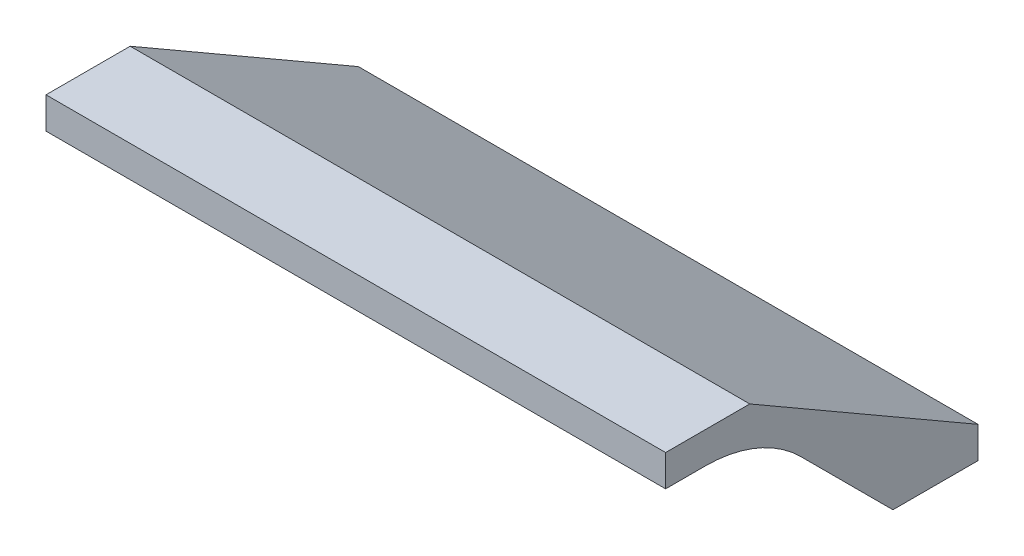
ISO-10303-21;
HEADER;
FILE_DESCRIPTION(('STEP AP214'),'2;1');
FILE_NAME('part.step','',(''),(''),'','','');
FILE_SCHEMA(('AUTOMOTIVE_DESIGN { 1 0 10303 214 1 1 1 1 }'));
ENDSEC;
DATA;
#1=APPLICATION_CONTEXT('core data for automotive mechanical design processes');
#2=APPLICATION_PROTOCOL_DEFINITION('international standard','automotive_design',2000,#1);
#3=PRODUCT_CONTEXT('',#1,'mechanical');
#4=PRODUCT('Part','Part','',(#3));
#5=PRODUCT_RELATED_PRODUCT_CATEGORY('part','',(#4));
#6=PRODUCT_DEFINITION_FORMATION('','',#4);
#7=PRODUCT_DEFINITION_CONTEXT('part definition',#1,'design');
#8=PRODUCT_DEFINITION('design','',#6,#7);
#9=PRODUCT_DEFINITION_SHAPE('','',#8);
#10=(LENGTH_UNIT() NAMED_UNIT(*) SI_UNIT(.MILLI.,.METRE.));
#11=(NAMED_UNIT(*) PLANE_ANGLE_UNIT() SI_UNIT($,.RADIAN.));
#12=(NAMED_UNIT(*) SI_UNIT($,.STERADIAN.) SOLID_ANGLE_UNIT());
#13=UNCERTAINTY_MEASURE_WITH_UNIT(LENGTH_MEASURE(1.E-05),#10,'distance_accuracy_value','');
#14=(GEOMETRIC_REPRESENTATION_CONTEXT(3) GLOBAL_UNCERTAINTY_ASSIGNED_CONTEXT((#13)) GLOBAL_UNIT_ASSIGNED_CONTEXT((#10,
#11,#12)) REPRESENTATION_CONTEXT('',''));
#15=CARTESIAN_POINT('',(0.,0.,0.));
#16=DIRECTION('',(0.,0.,1.));
#17=DIRECTION('',(1.,0.,0.));
#18=AXIS2_PLACEMENT_3D('',#15,#16,#17);
#19=CARTESIAN_POINT('',(-250.,0.,-77.097058469));
#20=DIRECTION('',(0.,1.,0.));
#21=DIRECTION('',(0.,0.,1.));
#22=AXIS2_PLACEMENT_3D('',#19,#20,#21);
#23=PLANE('',#22);
#24=DIRECTION('',(0.,0.,1.));
#25=VECTOR('',#24,1.);
#26=CARTESIAN_POINT('',(-250.,0.,-77.097058469));
#27=LINE('',#26,#25);
#28=CARTESIAN_POINT('',(-250.,0.,-31.8106775344438));
#29=VERTEX_POINT('',#28);
#30=CARTESIAN_POINT('',(-250.,0.,0.));
#31=VERTEX_POINT('',#30);
#32=EDGE_CURVE('E324',#29,#31,#27,.T.);
#33=ORIENTED_EDGE('',*,*,#32,.F.);
#34=DIRECTION('',(1.,0.,0.));
#35=VECTOR('',#34,1.);
#36=CARTESIAN_POINT('',(250.,0.,-31.8106775344438));
#37=LINE('',#36,#35);
#38=CARTESIAN_POINT('',(-139.7,0.,-31.810677540606));
#39=VERTEX_POINT('',#38);
#40=EDGE_CURVE('E293',#29,#39,#37,.T.);
#41=ORIENTED_EDGE('',*,*,#40,.T.);
#42=DIRECTION('',(0.,0.,-1.));
#43=VECTOR('',#42,1.);
#44=CARTESIAN_POINT('',(-139.7,0.,-31.810677540606));
#45=LINE('',#44,#43);
#46=CARTESIAN_POINT('',(-139.7,0.,-6.41067752457025));
#47=VERTEX_POINT('',#46);
#48=EDGE_CURVE('E310',#47,#39,#45,.T.);
#49=ORIENTED_EDGE('',*,*,#48,.F.);
#50=DIRECTION('',(-1.,0.,0.));
#51=VECTOR('',#50,1.);
#52=CARTESIAN_POINT('',(-139.7,0.,-6.41067752457025));
#53=LINE('',#52,#51);
#54=CARTESIAN_POINT('',(-50.8,0.,-6.41067752457025));
#55=VERTEX_POINT('',#54);
#56=EDGE_CURVE('E227',#55,#47,#53,.T.);
#57=ORIENTED_EDGE('',*,*,#56,.F.);
#58=DIRECTION('',(0.,0.,1.));
#59=VECTOR('',#58,1.);
#60=CARTESIAN_POINT('',(-50.8,0.,-6.41067752457025));
#61=LINE('',#60,#59);
#62=CARTESIAN_POINT('',(-50.8,0.,-31.810677540606));
#63=VERTEX_POINT('',#62);
#64=EDGE_CURVE('E222',#63,#55,#61,.T.);
#65=ORIENTED_EDGE('',*,*,#64,.F.);
#66=DIRECTION('',(1.,0.,0.));
#67=VECTOR('',#66,1.);
#68=CARTESIAN_POINT('',(250.,0.,-31.8106775344438));
#69=LINE('',#68,#67);
#70=CARTESIAN_POINT('',(50.8,0.,-31.810677540606));
#71=VERTEX_POINT('',#70);
#72=EDGE_CURVE('E285',#63,#71,#69,.T.);
#73=ORIENTED_EDGE('',*,*,#72,.T.);
#74=DIRECTION('',(0.,0.,-1.));
#75=VECTOR('',#74,1.);
#76=CARTESIAN_POINT('',(50.8,0.,-31.810677540606));
#77=LINE('',#76,#75);
#78=CARTESIAN_POINT('',(50.8,0.,-6.41067753108884));
#79=VERTEX_POINT('',#78);
#80=EDGE_CURVE('E215',#79,#71,#77,.T.);
#81=ORIENTED_EDGE('',*,*,#80,.F.);
#82=DIRECTION('',(-1.,0.,0.));
#83=VECTOR('',#82,1.);
#84=CARTESIAN_POINT('',(50.8,0.,-6.41067753108884));
#85=LINE('',#84,#83);
#86=CARTESIAN_POINT('',(139.7,0.,-6.41067753108884));
#87=VERTEX_POINT('',#86);
#88=EDGE_CURVE('E270',#87,#79,#85,.T.);
#89=ORIENTED_EDGE('',*,*,#88,.F.);
#90=DIRECTION('',(0.,0.,1.));
#91=VECTOR('',#90,1.);
#92=CARTESIAN_POINT('',(139.7,0.,-6.41067753108884));
#93=LINE('',#92,#91);
#94=CARTESIAN_POINT('',(139.7,0.,-31.810677540606));
#95=VERTEX_POINT('',#94);
#96=EDGE_CURVE('E267',#95,#87,#93,.T.);
#97=ORIENTED_EDGE('',*,*,#96,.F.);
#98=DIRECTION('',(1.,0.,0.));
#99=VECTOR('',#98,1.);
#100=CARTESIAN_POINT('',(250.,0.,-31.8106775344438));
#101=LINE('',#100,#99);
#102=CARTESIAN_POINT('',(250.,0.,-31.8106775344438));
#103=VERTEX_POINT('',#102);
#104=EDGE_CURVE('E280',#95,#103,#101,.T.);
#105=ORIENTED_EDGE('',*,*,#104,.T.);
#106=DIRECTION('',(0.,0.,1.));
#107=VECTOR('',#106,1.);
#108=CARTESIAN_POINT('',(250.,0.,-77.097058469));
#109=LINE('',#108,#107);
#110=CARTESIAN_POINT('',(250.,0.,0.));
#111=VERTEX_POINT('',#110);
#112=EDGE_CURVE('E336',#103,#111,#109,.T.);
#113=ORIENTED_EDGE('',*,*,#112,.T.);
#114=DIRECTION('',(1.,0.,0.));
#115=VECTOR('',#114,1.);
#116=CARTESIAN_POINT('',(-250.,0.,0.));
#117=LINE('',#116,#115);
#118=EDGE_CURVE('E403',#31,#111,#117,.T.);
#119=ORIENTED_EDGE('',*,*,#118,.F.);
#120=EDGE_LOOP('',(#33,#41,#49,#57,#65,#73,#81,#89,#97,#105,#113,#119));
#121=FACE_BOUND('',#120,.T.);
#122=ADVANCED_FACE('F45',(#121),#23,.F.);
#123=CARTESIAN_POINT('',(250.,-80.9302510564665,-252.081136019574));
#124=DIRECTION('',(0.,0.,-1.));
#125=DIRECTION('',(-1.,0.,0.));
#126=AXIS2_PLACEMENT_3D('',#123,#124,#125);
#127=PLANE('',#126);
#128=DIRECTION('',(0.,-1.,0.));
#129=VECTOR('',#128,1.);
#130=CARTESIAN_POINT('',(-250.,-80.9302510564665,-252.081136019574));
#131=LINE('',#130,#129);
#132=CARTESIAN_POINT('',(-250.,-80.9302510564665,-252.081136019574));
#133=VERTEX_POINT('',#132);
#134=CARTESIAN_POINT('',(-250.,-106.330251064987,-252.081136019574));
#135=VERTEX_POINT('',#134);
#136=EDGE_CURVE('E399',#133,#135,#131,.T.);
#137=ORIENTED_EDGE('',*,*,#136,.F.);
#138=DIRECTION('',(-1.,0.,0.));
#139=VECTOR('',#138,1.);
#140=CARTESIAN_POINT('',(250.,-80.9302510564665,-252.081136019574));
#141=LINE('',#140,#139);
#142=CARTESIAN_POINT('',(250.,-80.9302510564665,-252.081136019574));
#143=VERTEX_POINT('',#142);
#144=EDGE_CURVE('E286',#143,#133,#141,.T.);
#145=ORIENTED_EDGE('',*,*,#144,.F.);
#146=DIRECTION('',(0.,-1.,0.));
#147=VECTOR('',#146,1.);
#148=CARTESIAN_POINT('',(250.,-80.9302510564665,-252.081136019574));
#149=LINE('',#148,#147);
#150=CARTESIAN_POINT('',(250.,-106.330251064987,-252.081136019574));
#151=VERTEX_POINT('',#150);
#152=EDGE_CURVE('E408',#143,#151,#149,.T.);
#153=ORIENTED_EDGE('',*,*,#152,.T.);
#154=DIRECTION('',(-1.,0.,0.));
#155=VECTOR('',#154,1.);
#156=CARTESIAN_POINT('',(250.,-106.330251064987,-252.081136019574));
#157=LINE('',#156,#155);
#158=EDGE_CURVE('E287',#151,#135,#157,.T.);
#159=ORIENTED_EDGE('',*,*,#158,.T.);
#160=EDGE_LOOP('',(#137,#145,#153,#159));
#161=FACE_BOUND('',#160,.T.);
#162=ADVANCED_FACE('F504',(#161),#127,.T.);
#163=CARTESIAN_POINT('',(250.,25.401284991,-67.9095131385199));
#164=DIRECTION('',(0.,0.866025403784439,-0.5));
#165=DIRECTION('',(0.,0.5,0.866025403784439));
#166=AXIS2_PLACEMENT_3D('',#163,#164,#165);
#167=PLANE('',#166);
#168=DIRECTION('',(0.,-0.5,-0.866025403784439));
#169=VECTOR('',#168,1.);
#170=CARTESIAN_POINT('',(-250.,25.401284991,-67.9095131385199));
#171=LINE('',#170,#169);
#172=CARTESIAN_POINT('',(-250.,25.401284991,-67.9095131385199));
#173=VERTEX_POINT('',#172);
#174=EDGE_CURVE('E405',#173,#133,#171,.T.);
#175=ORIENTED_EDGE('',*,*,#174,.F.);
#176=DIRECTION('',(-1.,0.,0.));
#177=VECTOR('',#176,1.);
#178=CARTESIAN_POINT('',(250.,25.401284991,-67.9095131385199));
#179=LINE('',#178,#177);
#180=CARTESIAN_POINT('',(250.,25.401284991,-67.9095131385199));
#181=VERTEX_POINT('',#180);
#182=EDGE_CURVE('E485',#181,#173,#179,.T.);
#183=ORIENTED_EDGE('',*,*,#182,.F.);
#184=DIRECTION('',(0.,-0.5,-0.866025403784439));
#185=VECTOR('',#184,1.);
#186=CARTESIAN_POINT('',(250.,25.401284991,-67.9095131385199));
#187=LINE('',#186,#185);
#188=EDGE_CURVE('E453',#181,#143,#187,.T.);
#189=ORIENTED_EDGE('',*,*,#188,.T.);
#190=ORIENTED_EDGE('',*,*,#144,.T.);
#191=EDGE_LOOP('',(#175,#183,#189,#190));
#192=FACE_BOUND('',#191,.T.);
#193=ADVANCED_FACE('F500',(#192),#167,.T.);
#194=CARTESIAN_POINT('',(250.,25.401284991,0.));
#195=DIRECTION('',(0.,1.,0.));
#196=DIRECTION('',(0.,0.,1.));
#197=AXIS2_PLACEMENT_3D('',#194,#195,#196);
#198=PLANE('',#197);
#199=DIRECTION('',(0.,0.,-1.));
#200=VECTOR('',#199,1.);
#201=CARTESIAN_POINT('',(-250.,25.401284991,0.));
#202=LINE('',#201,#200);
#203=CARTESIAN_POINT('',(-250.,25.401284991,0.));
#204=VERTEX_POINT('',#203);
#205=EDGE_CURVE('E409',#204,#173,#202,.T.);
#206=ORIENTED_EDGE('',*,*,#205,.F.);
#207=DIRECTION('',(-1.,0.,0.));
#208=VECTOR('',#207,1.);
#209=CARTESIAN_POINT('',(250.,25.401284991,0.));
#210=LINE('',#209,#208);
#211=CARTESIAN_POINT('',(250.,25.401284991,0.));
#212=VERTEX_POINT('',#211);
#213=EDGE_CURVE('E481',#212,#204,#210,.T.);
#214=ORIENTED_EDGE('',*,*,#213,.F.);
#215=DIRECTION('',(0.,0.,-1.));
#216=VECTOR('',#215,1.);
#217=CARTESIAN_POINT('',(250.,25.401284991,0.));
#218=LINE('',#217,#216);
#219=EDGE_CURVE('E446',#212,#181,#218,.T.);
#220=ORIENTED_EDGE('',*,*,#219,.T.);
#221=ORIENTED_EDGE('',*,*,#182,.T.);
#222=EDGE_LOOP('',(#206,#214,#220,#221));
#223=FACE_BOUND('',#222,.T.);
#224=ADVANCED_FACE('F511',(#223),#198,.T.);
#225=CARTESIAN_POINT('',(250.,-106.330251064987,0.));
#226=DIRECTION('',(0.,0.,1.));
#227=DIRECTION('',(0.,-1.,0.));
#228=AXIS2_PLACEMENT_3D('',#225,#226,#227);
#229=PLANE('',#228);
#230=ORIENTED_EDGE('',*,*,#118,.T.);
#231=DIRECTION('',(0.,1.,0.));
#232=VECTOR('',#231,1.);
#233=CARTESIAN_POINT('',(250.,-106.330251064987,0.));
#234=LINE('',#233,#232);
#235=EDGE_CURVE('E443',#111,#212,#234,.T.);
#236=ORIENTED_EDGE('',*,*,#235,.T.);
#237=ORIENTED_EDGE('',*,*,#213,.T.);
#238=DIRECTION('',(0.,1.,0.));
#239=VECTOR('',#238,1.);
#240=CARTESIAN_POINT('',(-250.,-106.330251064987,0.));
#241=LINE('',#240,#239);
#242=EDGE_CURVE('E398',#31,#204,#241,.T.);
#243=ORIENTED_EDGE('',*,*,#242,.F.);
#244=EDGE_LOOP('',(#230,#236,#237,#243));
#245=FACE_BOUND('',#244,.T.);
#246=ADVANCED_FACE('F643',(#245),#229,.T.);
#247=CARTESIAN_POINT('',(250.,-106.330251064987,-252.081136019574));
#248=DIRECTION('',(0.,-1.,0.));
#249=DIRECTION('',(0.,0.,-1.));
#250=AXIS2_PLACEMENT_3D('',#247,#248,#249);
#251=PLANE('',#250);
#252=DIRECTION('',(1.,0.,0.));
#253=VECTOR('',#252,1.);
#254=CARTESIAN_POINT('',(-250.,-106.33025104,-183.427309509));
#255=LINE('',#254,#253);
#256=CARTESIAN_POINT('',(-250.,-106.33025104,-183.427309509));
#257=VERTEX_POINT('',#256);
#258=CARTESIAN_POINT('',(250.,-106.33025104,-183.427309509));
#259=VERTEX_POINT('',#258);
#260=EDGE_CURVE('E329',#257,#259,#255,.T.);
#261=ORIENTED_EDGE('',*,*,#260,.F.);
#262=DIRECTION('',(0.,0.,1.));
#263=VECTOR('',#262,1.);
#264=CARTESIAN_POINT('',(-250.,-106.330251064987,-252.081136019574));
#265=LINE('',#264,#263);
#266=EDGE_CURVE('E395',#135,#257,#265,.T.);
#267=ORIENTED_EDGE('',*,*,#266,.F.);
#268=ORIENTED_EDGE('',*,*,#158,.F.);
#269=DIRECTION('',(0.,0.,1.));
#270=VECTOR('',#269,1.);
#271=CARTESIAN_POINT('',(250.,-106.330251064987,-252.081136019574));
#272=LINE('',#271,#270);
#273=EDGE_CURVE('E450',#151,#259,#272,.T.);
#274=ORIENTED_EDGE('',*,*,#273,.T.);
#275=EDGE_LOOP('',(#261,#267,#268,#274));
#276=FACE_BOUND('',#275,.T.);
#277=ADVANCED_FACE('F518',(#276),#251,.T.);
#278=CARTESIAN_POINT('',(250.,0.,0.));
#279=DIRECTION('',(-1.,0.,0.));
#280=DIRECTION('',(0.,0.,1.));
#281=AXIS2_PLACEMENT_3D('',#278,#279,#280);
#282=PLANE('',#281);
#283=ORIENTED_EDGE('',*,*,#235,.F.);
#284=ORIENTED_EDGE('',*,*,#112,.F.);
#285=CARTESIAN_POINT('',(250.,-109.330995043,-31.8106775344438));
#286=DIRECTION('',(-1.,0.,0.));
#287=DIRECTION('',(0.,0.,1.));
#288=AXIS2_PLACEMENT_3D('',#285,#286,#287);
#289=CIRCLE('',#288,109.330995043);
#290=CARTESIAN_POINT('',(250.,-32.0223070542218,-109.119365523222));
#291=VERTEX_POINT('',#290);
#292=EDGE_CURVE('E55',#103,#291,#289,.T.);
#293=ORIENTED_EDGE('',*,*,#292,.T.);
#294=DIRECTION('',(0.,0.707106781186547,0.707106781186548));
#295=VECTOR('',#294,1.);
#296=CARTESIAN_POINT('',(250.,-106.33025104,-183.427309509));
#297=LINE('',#296,#295);
#298=EDGE_CURVE('E333',#259,#291,#297,.T.);
#299=ORIENTED_EDGE('',*,*,#298,.F.);
#300=ORIENTED_EDGE('',*,*,#273,.F.);
#301=ORIENTED_EDGE('',*,*,#152,.F.);
#302=ORIENTED_EDGE('',*,*,#188,.F.);
#303=ORIENTED_EDGE('',*,*,#219,.F.);
#304=EDGE_LOOP('',(#283,#284,#293,#299,#300,#301,#302,#303));
#305=FACE_BOUND('',#304,.T.);
#306=ADVANCED_FACE('F441',(#305),#282,.F.);
#307=CARTESIAN_POINT('',(-250.,0.,0.));
#308=DIRECTION('',(-1.,0.,0.));
#309=DIRECTION('',(0.,0.,1.));
#310=AXIS2_PLACEMENT_3D('',#307,#308,#309);
#311=PLANE('',#310);
#312=DIRECTION('',(0.,0.707106781186547,0.707106781186548));
#313=VECTOR('',#312,1.);
#314=CARTESIAN_POINT('',(-250.,-106.33025104,-183.427309509));
#315=LINE('',#314,#313);
#316=CARTESIAN_POINT('',(-250.,-32.0223070542218,-109.119365523222));
#317=VERTEX_POINT('',#316);
#318=EDGE_CURVE('E330',#257,#317,#315,.T.);
#319=ORIENTED_EDGE('',*,*,#318,.T.);
#320=CARTESIAN_POINT('',(-250.,-109.330995043,-31.8106775344438));
#321=DIRECTION('',(-1.,0.,0.));
#322=DIRECTION('',(0.,0.,1.));
#323=AXIS2_PLACEMENT_3D('',#320,#321,#322);
#324=CIRCLE('',#323,109.330995043);
#325=EDGE_CURVE('E12',#317,#29,#324,.F.);
#326=ORIENTED_EDGE('',*,*,#325,.T.);
#327=ORIENTED_EDGE('',*,*,#32,.T.);
#328=ORIENTED_EDGE('',*,*,#242,.T.);
#329=ORIENTED_EDGE('',*,*,#205,.T.);
#330=ORIENTED_EDGE('',*,*,#174,.T.);
#331=ORIENTED_EDGE('',*,*,#136,.T.);
#332=ORIENTED_EDGE('',*,*,#266,.T.);
#333=EDGE_LOOP('',(#319,#326,#327,#328,#329,#330,#331,#332));
#334=FACE_BOUND('',#333,.T.);
#335=ADVANCED_FACE('F507',(#334),#311,.T.);
#336=CARTESIAN_POINT('',(-250.,-106.33025104,-183.427309509));
#337=DIRECTION('',(0.,0.707106781186548,-0.707106781186547));
#338=DIRECTION('',(0.,0.707106781186547,0.707106781186548));
#339=AXIS2_PLACEMENT_3D('',#336,#337,#338);
#340=PLANE('',#339);
#341=ORIENTED_EDGE('',*,*,#298,.T.);
#342=DIRECTION('',(1.,0.,0.));
#343=VECTOR('',#342,1.);
#344=CARTESIAN_POINT('',(-250.,-32.0223070542218,-109.119365523222));
#345=LINE('',#344,#343);
#346=EDGE_CURVE('E65',#291,#317,#345,.F.);
#347=ORIENTED_EDGE('',*,*,#346,.T.);
#348=ORIENTED_EDGE('',*,*,#318,.F.);
#349=ORIENTED_EDGE('',*,*,#260,.T.);
#350=EDGE_LOOP('',(#341,#347,#348,#349));
#351=FACE_BOUND('',#350,.T.);
#352=ADVANCED_FACE('F519',(#351),#340,.F.);
#353=CARTESIAN_POINT('',(-50.8,-1.,-6.41067752457025));
#354=DIRECTION('',(-1.,0.,0.));
#355=DIRECTION('',(0.,0.,1.));
#356=AXIS2_PLACEMENT_3D('',#353,#354,#355);
#357=PLANE('',#356);
#358=ORIENTED_EDGE('',*,*,#64,.T.);
#359=DIRECTION('',(0.,1.,0.));
#360=VECTOR('',#359,1.);
#361=CARTESIAN_POINT('',(-50.8,-1.,-6.41067752457025));
#362=LINE('',#361,#360);
#363=CARTESIAN_POINT('',(-50.8,-1.,-6.41067752457025));
#364=VERTEX_POINT('',#363);
#365=EDGE_CURVE('E337',#364,#55,#362,.T.);
#366=ORIENTED_EDGE('',*,*,#365,.F.);
#367=DIRECTION('',(0.,0.,1.));
#368=VECTOR('',#367,1.);
#369=CARTESIAN_POINT('',(-50.8,-1.,-6.41067752457025));
#370=LINE('',#369,#368);
#371=CARTESIAN_POINT('',(-50.8,-1.,-31.810677540606));
#372=VERTEX_POINT('',#371);
#373=EDGE_CURVE('E236',#372,#364,#370,.T.);
#374=ORIENTED_EDGE('',*,*,#373,.F.);
#375=DIRECTION('',(0.,1.,0.));
#376=VECTOR('',#375,1.);
#377=CARTESIAN_POINT('',(-50.8,-1.,-31.810677540606));
#378=LINE('',#377,#376);
#379=EDGE_CURVE('E348',#372,#63,#378,.T.);
#380=ORIENTED_EDGE('',*,*,#379,.T.);
#381=EDGE_LOOP('',(#358,#366,#374,#380));
#382=FACE_BOUND('',#381,.T.);
#383=ADVANCED_FACE('F387',(#382),#357,.F.);
#384=CARTESIAN_POINT('',(-139.7,-1.,-6.41067752457025));
#385=DIRECTION('',(0.,0.,-1.));
#386=DIRECTION('',(-1.,0.,0.));
#387=AXIS2_PLACEMENT_3D('',#384,#385,#386);
#388=PLANE('',#387);
#389=ORIENTED_EDGE('',*,*,#56,.T.);
#390=DIRECTION('',(0.,1.,0.));
#391=VECTOR('',#390,1.);
#392=CARTESIAN_POINT('',(-139.7,-1.,-6.41067752457025));
#393=LINE('',#392,#391);
#394=CARTESIAN_POINT('',(-139.7,-1.,-6.41067752457025));
#395=VERTEX_POINT('',#394);
#396=EDGE_CURVE('E358',#395,#47,#393,.T.);
#397=ORIENTED_EDGE('',*,*,#396,.F.);
#398=DIRECTION('',(-1.,0.,0.));
#399=VECTOR('',#398,1.);
#400=CARTESIAN_POINT('',(-139.7,-1.,-6.41067752457025));
#401=LINE('',#400,#399);
#402=EDGE_CURVE('E364',#364,#395,#401,.T.);
#403=ORIENTED_EDGE('',*,*,#402,.F.);
#404=ORIENTED_EDGE('',*,*,#365,.T.);
#405=EDGE_LOOP('',(#389,#397,#403,#404));
#406=FACE_BOUND('',#405,.T.);
#407=ADVANCED_FACE('F436',(#406),#388,.F.);
#408=CARTESIAN_POINT('',(-139.7,-1.,-31.810677540606));
#409=DIRECTION('',(1.,0.,0.));
#410=DIRECTION('',(0.,0.,-1.));
#411=AXIS2_PLACEMENT_3D('',#408,#409,#410);
#412=PLANE('',#411);
#413=ORIENTED_EDGE('',*,*,#48,.T.);
#414=DIRECTION('',(0.,1.,0.));
#415=VECTOR('',#414,1.);
#416=CARTESIAN_POINT('',(-139.7,-1.,-31.810677540606));
#417=LINE('',#416,#415);
#418=CARTESIAN_POINT('',(-139.7,-1.,-31.810677540606));
#419=VERTEX_POINT('',#418);
#420=EDGE_CURVE('E353',#419,#39,#417,.T.);
#421=ORIENTED_EDGE('',*,*,#420,.F.);
#422=DIRECTION('',(0.,0.,-1.));
#423=VECTOR('',#422,1.);
#424=CARTESIAN_POINT('',(-139.7,-1.,-31.810677540606));
#425=LINE('',#424,#423);
#426=EDGE_CURVE('E367',#395,#419,#425,.T.);
#427=ORIENTED_EDGE('',*,*,#426,.F.);
#428=ORIENTED_EDGE('',*,*,#396,.T.);
#429=EDGE_LOOP('',(#413,#421,#427,#428));
#430=FACE_BOUND('',#429,.T.);
#431=ADVANCED_FACE('F432',(#430),#412,.F.);
#432=CARTESIAN_POINT('',(-50.8,-1.,-31.810677540606));
#433=DIRECTION('',(0.,0.,1.));
#434=DIRECTION('',(1.,0.,0.));
#435=AXIS2_PLACEMENT_3D('',#432,#433,#434);
#436=PLANE('',#435);
#437=DIRECTION('',(1.,0.,0.));
#438=VECTOR('',#437,1.);
#439=CARTESIAN_POINT('',(-50.8,0.,-31.810677540606));
#440=LINE('',#439,#438);
#441=EDGE_CURVE('E315',#39,#63,#440,.T.);
#442=ORIENTED_EDGE('',*,*,#441,.T.);
#443=ORIENTED_EDGE('',*,*,#379,.F.);
#444=DIRECTION('',(1.,0.,0.));
#445=VECTOR('',#444,1.);
#446=CARTESIAN_POINT('',(-50.8,-1.,-31.810677540606));
#447=LINE('',#446,#445);
#448=EDGE_CURVE('E303',#419,#372,#447,.T.);
#449=ORIENTED_EDGE('',*,*,#448,.F.);
#450=ORIENTED_EDGE('',*,*,#420,.T.);
#451=EDGE_LOOP('',(#442,#443,#449,#450));
#452=FACE_BOUND('',#451,.T.);
#453=ADVANCED_FACE('F384',(#452),#436,.F.);
#454=CARTESIAN_POINT('',(0.,-1.,0.));
#455=DIRECTION('',(0.,1.,0.));
#456=DIRECTION('',(0.,0.,1.));
#457=AXIS2_PLACEMENT_3D('',#454,#455,#456);
#458=PLANE('',#457);
#459=ORIENTED_EDGE('',*,*,#373,.T.);
#460=ORIENTED_EDGE('',*,*,#402,.T.);
#461=ORIENTED_EDGE('',*,*,#426,.T.);
#462=ORIENTED_EDGE('',*,*,#448,.T.);
#463=EDGE_LOOP('',(#459,#460,#461,#462));
#464=FACE_BOUND('',#463,.T.);
#465=ADVANCED_FACE('F379',(#464),#458,.F.);
#466=CARTESIAN_POINT('',(139.7,-1.,-31.810677540606));
#467=DIRECTION('',(0.,0.,1.));
#468=DIRECTION('',(1.,0.,0.));
#469=AXIS2_PLACEMENT_3D('',#466,#467,#468);
#470=PLANE('',#469);
#471=DIRECTION('',(1.,0.,0.));
#472=VECTOR('',#471,1.);
#473=CARTESIAN_POINT('',(139.7,0.,-31.810677540606));
#474=LINE('',#473,#472);
#475=EDGE_CURVE('E219',#71,#95,#474,.T.);
#476=ORIENTED_EDGE('',*,*,#475,.T.);
#477=DIRECTION('',(0.,1.,0.));
#478=VECTOR('',#477,1.);
#479=CARTESIAN_POINT('',(139.7,-1.,-31.810677540606));
#480=LINE('',#479,#478);
#481=CARTESIAN_POINT('',(139.7,-1.,-31.810677540606));
#482=VERTEX_POINT('',#481);
#483=EDGE_CURVE('E197',#482,#95,#480,.T.);
#484=ORIENTED_EDGE('',*,*,#483,.F.);
#485=DIRECTION('',(1.,0.,0.));
#486=VECTOR('',#485,1.);
#487=CARTESIAN_POINT('',(139.7,-1.,-31.810677540606));
#488=LINE('',#487,#486);
#489=CARTESIAN_POINT('',(50.8,-1.,-31.810677540606));
#490=VERTEX_POINT('',#489);
#491=EDGE_CURVE('E205',#490,#482,#488,.T.);
#492=ORIENTED_EDGE('',*,*,#491,.F.);
#493=DIRECTION('',(0.,1.,0.));
#494=VECTOR('',#493,1.);
#495=CARTESIAN_POINT('',(50.8,-1.,-31.810677540606));
#496=LINE('',#495,#494);
#497=EDGE_CURVE('E250',#490,#71,#496,.T.);
#498=ORIENTED_EDGE('',*,*,#497,.T.);
#499=EDGE_LOOP('',(#476,#484,#492,#498));
#500=FACE_BOUND('',#499,.T.);
#501=ADVANCED_FACE('F217',(#500),#470,.F.);
#502=CARTESIAN_POINT('',(139.7,-1.,-6.41067753108884));
#503=DIRECTION('',(-1.,0.,0.));
#504=DIRECTION('',(0.,0.,1.));
#505=AXIS2_PLACEMENT_3D('',#502,#503,#504);
#506=PLANE('',#505);
#507=ORIENTED_EDGE('',*,*,#96,.T.);
#508=DIRECTION('',(0.,1.,0.));
#509=VECTOR('',#508,1.);
#510=CARTESIAN_POINT('',(139.7,-1.,-6.41067753108884));
#511=LINE('',#510,#509);
#512=CARTESIAN_POINT('',(139.7,-1.,-6.41067753108884));
#513=VERTEX_POINT('',#512);
#514=EDGE_CURVE('E200',#513,#87,#511,.T.);
#515=ORIENTED_EDGE('',*,*,#514,.F.);
#516=DIRECTION('',(0.,0.,1.));
#517=VECTOR('',#516,1.);
#518=CARTESIAN_POINT('',(139.7,-1.,-6.41067753108884));
#519=LINE('',#518,#517);
#520=EDGE_CURVE('E192',#482,#513,#519,.T.);
#521=ORIENTED_EDGE('',*,*,#520,.F.);
#522=ORIENTED_EDGE('',*,*,#483,.T.);
#523=EDGE_LOOP('',(#507,#515,#521,#522));
#524=FACE_BOUND('',#523,.T.);
#525=ADVANCED_FACE('F195',(#524),#506,.F.);
#526=CARTESIAN_POINT('',(50.8,-1.,-6.41067753108884));
#527=DIRECTION('',(0.,0.,-1.));
#528=DIRECTION('',(-1.,0.,0.));
#529=AXIS2_PLACEMENT_3D('',#526,#527,#528);
#530=PLANE('',#529);
#531=ORIENTED_EDGE('',*,*,#88,.T.);
#532=DIRECTION('',(0.,1.,0.));
#533=VECTOR('',#532,1.);
#534=CARTESIAN_POINT('',(50.8,-1.,-6.41067753108884));
#535=LINE('',#534,#533);
#536=CARTESIAN_POINT('',(50.8,-1.,-6.41067753108884));
#537=VERTEX_POINT('',#536);
#538=EDGE_CURVE('E230',#537,#79,#535,.T.);
#539=ORIENTED_EDGE('',*,*,#538,.F.);
#540=DIRECTION('',(-1.,0.,0.));
#541=VECTOR('',#540,1.);
#542=CARTESIAN_POINT('',(50.8,-1.,-6.41067753108884));
#543=LINE('',#542,#541);
#544=EDGE_CURVE('E204',#513,#537,#543,.T.);
#545=ORIENTED_EDGE('',*,*,#544,.F.);
#546=ORIENTED_EDGE('',*,*,#514,.T.);
#547=EDGE_LOOP('',(#531,#539,#545,#546));
#548=FACE_BOUND('',#547,.T.);
#549=ADVANCED_FACE('F560',(#548),#530,.F.);
#550=CARTESIAN_POINT('',(50.8,-1.,-31.810677540606));
#551=DIRECTION('',(1.,0.,0.));
#552=DIRECTION('',(0.,0.,-1.));
#553=AXIS2_PLACEMENT_3D('',#550,#551,#552);
#554=PLANE('',#553);
#555=ORIENTED_EDGE('',*,*,#80,.T.);
#556=ORIENTED_EDGE('',*,*,#497,.F.);
#557=DIRECTION('',(0.,0.,-1.));
#558=VECTOR('',#557,1.);
#559=CARTESIAN_POINT('',(50.8,-1.,-31.810677540606));
#560=LINE('',#559,#558);
#561=EDGE_CURVE('E210',#537,#490,#560,.T.);
#562=ORIENTED_EDGE('',*,*,#561,.F.);
#563=ORIENTED_EDGE('',*,*,#538,.T.);
#564=EDGE_LOOP('',(#555,#556,#562,#563));
#565=FACE_BOUND('',#564,.T.);
#566=ADVANCED_FACE('F438',(#565),#554,.F.);
#567=CARTESIAN_POINT('',(0.,-1.,0.));
#568=DIRECTION('',(0.,1.,0.));
#569=DIRECTION('',(0.,0.,1.));
#570=AXIS2_PLACEMENT_3D('',#567,#568,#569);
#571=PLANE('',#570);
#572=ORIENTED_EDGE('',*,*,#491,.T.);
#573=ORIENTED_EDGE('',*,*,#520,.T.);
#574=ORIENTED_EDGE('',*,*,#544,.T.);
#575=ORIENTED_EDGE('',*,*,#561,.T.);
#576=EDGE_LOOP('',(#572,#573,#574,#575));
#577=FACE_BOUND('',#576,.T.);
#578=ADVANCED_FACE('F208',(#577),#571,.F.);
#579=CARTESIAN_POINT('',(-250.,-109.330995043,-31.8106775344438));
#580=DIRECTION('',(-1.,0.,0.));
#581=DIRECTION('',(0.,0.,1.));
#582=AXIS2_PLACEMENT_3D('',#579,#580,#581);
#583=CYLINDRICAL_SURFACE('',#582,109.330995043);
#584=ORIENTED_EDGE('',*,*,#325,.F.);
#585=ORIENTED_EDGE('',*,*,#346,.F.);
#586=ORIENTED_EDGE('',*,*,#292,.F.);
#587=ORIENTED_EDGE('',*,*,#104,.F.);
#588=ORIENTED_EDGE('',*,*,#475,.F.);
#589=ORIENTED_EDGE('',*,*,#72,.F.);
#590=ORIENTED_EDGE('',*,*,#441,.F.);
#591=ORIENTED_EDGE('',*,*,#40,.F.);
#592=EDGE_LOOP('',(#584,#585,#586,#587,#588,#589,#590,#591));
#593=FACE_BOUND('',#592,.T.);
#594=ADVANCED_FACE('F48',(#593),#583,.F.);
#595=CLOSED_SHELL('',(#122,#162,#193,#224,#246,#277,#306,#335,#352,#383,#407,#431,#453,#465,
#501,#525,#549,#566,#578,#594));
#596=MANIFOLD_SOLID_BREP('B2',#595);
#597=ADVANCED_BREP_SHAPE_REPRESENTATION('',(#18,#596),#14);
#598=SHAPE_DEFINITION_REPRESENTATION(#9,#597);
ENDSEC;
END-ISO-10303-21;
